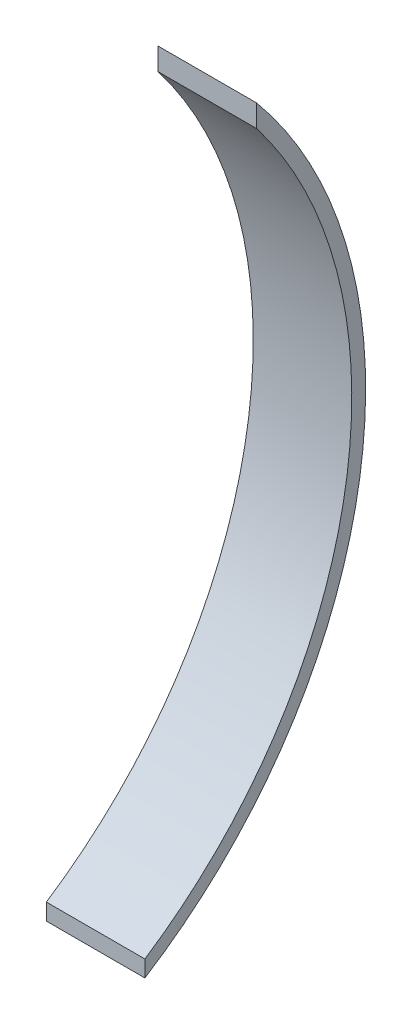
ISO-10303-21;
HEADER;
FILE_DESCRIPTION(('STEP AP214'),'2;1');
FILE_NAME('part.step','',(''),(''),'','','');
FILE_SCHEMA(('AUTOMOTIVE_DESIGN { 1 0 10303 214 1 1 1 1 }'));
ENDSEC;
DATA;
#1=APPLICATION_CONTEXT('core data for automotive mechanical design processes');
#2=APPLICATION_PROTOCOL_DEFINITION('international standard','automotive_design',2000,#1);
#3=PRODUCT_CONTEXT('',#1,'mechanical');
#4=PRODUCT('Part','Part','',(#3));
#5=PRODUCT_RELATED_PRODUCT_CATEGORY('part','',(#4));
#6=PRODUCT_DEFINITION_FORMATION('','',#4);
#7=PRODUCT_DEFINITION_CONTEXT('part definition',#1,'design');
#8=PRODUCT_DEFINITION('design','',#6,#7);
#9=PRODUCT_DEFINITION_SHAPE('','',#8);
#10=(LENGTH_UNIT() NAMED_UNIT(*) SI_UNIT(.MILLI.,.METRE.));
#11=(NAMED_UNIT(*) PLANE_ANGLE_UNIT() SI_UNIT($,.RADIAN.));
#12=(NAMED_UNIT(*) SI_UNIT($,.STERADIAN.) SOLID_ANGLE_UNIT());
#13=UNCERTAINTY_MEASURE_WITH_UNIT(LENGTH_MEASURE(1.E-05),#10,'distance_accuracy_value','');
#14=(GEOMETRIC_REPRESENTATION_CONTEXT(3) GLOBAL_UNCERTAINTY_ASSIGNED_CONTEXT((#13)) GLOBAL_UNIT_ASSIGNED_CONTEXT((#10,
#11,#12)) REPRESENTATION_CONTEXT('',''));
#15=CARTESIAN_POINT('',(0.,0.,0.));
#16=DIRECTION('',(0.,0.,1.));
#17=DIRECTION('',(1.,0.,0.));
#18=AXIS2_PLACEMENT_3D('',#15,#16,#17);
#19=CARTESIAN_POINT('',(30.,-30.789886547677,76.726917698007));
#20=DIRECTION('',(-1.,0.,0.));
#21=DIRECTION('',(0.,0.,1.));
#22=AXIS2_PLACEMENT_3D('',#19,#20,#21);
#23=CYLINDRICAL_SURFACE('',#22,139.726917698007);
#24=CARTESIAN_POINT('',(0.,-30.789886547677,76.726917698007));
#25=DIRECTION('',(-1.,0.,0.));
#26=DIRECTION('',(0.,0.,1.));
#27=AXIS2_PLACEMENT_3D('',#24,#25,#26);
#28=CIRCLE('',#27,139.726917698007);
#29=CARTESIAN_POINT('',(0.,54.4342956219654,-34.));
#30=VERTEX_POINT('',#29);
#31=CARTESIAN_POINT('',(0.,-147.565704378035,0.));
#32=VERTEX_POINT('',#31);
#33=EDGE_CURVE('E117',#30,#32,#28,.T.);
#34=ORIENTED_EDGE('',*,*,#33,.T.);
#35=DIRECTION('',(-1.,0.,0.));
#36=VECTOR('',#35,1.);
#37=CARTESIAN_POINT('',(30.,-147.565704378035,0.));
#38=LINE('',#37,#36);
#39=CARTESIAN_POINT('',(30.,-147.565704378035,0.));
#40=VERTEX_POINT('',#39);
#41=EDGE_CURVE('E13',#40,#32,#38,.T.);
#42=ORIENTED_EDGE('',*,*,#41,.F.);
#43=CARTESIAN_POINT('',(30.,-30.789886547677,76.726917698007));
#44=DIRECTION('',(-1.,0.,0.));
#45=DIRECTION('',(0.,0.,1.));
#46=AXIS2_PLACEMENT_3D('',#43,#44,#45);
#47=CIRCLE('',#46,139.726917698007);
#48=CARTESIAN_POINT('',(30.,54.4342956219654,-34.));
#49=VERTEX_POINT('',#48);
#50=EDGE_CURVE('E101',#49,#40,#47,.T.);
#51=ORIENTED_EDGE('',*,*,#50,.F.);
#52=DIRECTION('',(-1.,0.,0.));
#53=VECTOR('',#52,1.);
#54=CARTESIAN_POINT('',(30.,54.4342956219654,-34.));
#55=LINE('',#54,#53);
#56=EDGE_CURVE('E113',#49,#30,#55,.T.);
#57=ORIENTED_EDGE('',*,*,#56,.T.);
#58=EDGE_LOOP('',(#34,#42,#51,#57));
#59=FACE_BOUND('',#58,.T.);
#60=ADVANCED_FACE('F49',(#59),#23,.F.);
#61=CARTESIAN_POINT('',(30.,-147.565704378035,0.));
#62=DIRECTION('',(0.,0.,-1.));
#63=DIRECTION('',(0.,1.,0.));
#64=AXIS2_PLACEMENT_3D('',#61,#62,#63);
#65=PLANE('',#64);
#66=DIRECTION('',(0.,-1.,0.));
#67=VECTOR('',#66,1.);
#68=CARTESIAN_POINT('',(0.,-147.565704378035,0.));
#69=LINE('',#68,#67);
#70=CARTESIAN_POINT('',(0.,-152.588372424716,0.));
#71=VERTEX_POINT('',#70);
#72=EDGE_CURVE('E106',#32,#71,#69,.T.);
#73=ORIENTED_EDGE('',*,*,#72,.T.);
#74=DIRECTION('',(-1.,0.,0.));
#75=VECTOR('',#74,1.);
#76=CARTESIAN_POINT('',(30.,-152.588372424716,0.));
#77=LINE('',#76,#75);
#78=CARTESIAN_POINT('',(30.,-152.588372424716,0.));
#79=VERTEX_POINT('',#78);
#80=EDGE_CURVE('E58',#79,#71,#77,.T.);
#81=ORIENTED_EDGE('',*,*,#80,.F.);
#82=DIRECTION('',(0.,-1.,0.));
#83=VECTOR('',#82,1.);
#84=CARTESIAN_POINT('',(30.,-147.565704378035,0.));
#85=LINE('',#84,#83);
#86=EDGE_CURVE('E96',#40,#79,#85,.T.);
#87=ORIENTED_EDGE('',*,*,#86,.F.);
#88=ORIENTED_EDGE('',*,*,#41,.T.);
#89=EDGE_LOOP('',(#73,#81,#87,#88));
#90=FACE_BOUND('',#89,.T.);
#91=ADVANCED_FACE('F105',(#90),#65,.F.);
#92=CARTESIAN_POINT('',(30.,-30.789886547677,76.726917698007));
#93=DIRECTION('',(-1.,0.,0.));
#94=DIRECTION('',(0.,0.,1.));
#95=AXIS2_PLACEMENT_3D('',#92,#93,#94);
#96=CYLINDRICAL_SURFACE('',#95,143.951002293753);
#97=CARTESIAN_POINT('',(0.,-30.789886547677,76.726917698007));
#98=DIRECTION('',(1.,0.,0.));
#99=DIRECTION('',(0.,0.,1.));
#100=AXIS2_PLACEMENT_3D('',#97,#98,#99);
#101=CIRCLE('',#100,143.951002293753);
#102=CARTESIAN_POINT('',(0.,61.196203479429,-34.));
#103=VERTEX_POINT('',#102);
#104=EDGE_CURVE('E83',#71,#103,#101,.T.);
#105=ORIENTED_EDGE('',*,*,#104,.T.);
#106=DIRECTION('',(-1.,0.,0.));
#107=VECTOR('',#106,1.);
#108=CARTESIAN_POINT('',(30.,61.196203479429,-34.));
#109=LINE('',#108,#107);
#110=CARTESIAN_POINT('',(30.,61.196203479429,-34.));
#111=VERTEX_POINT('',#110);
#112=EDGE_CURVE('E108',#111,#103,#109,.T.);
#113=ORIENTED_EDGE('',*,*,#112,.F.);
#114=CARTESIAN_POINT('',(30.,-30.789886547677,76.726917698007));
#115=DIRECTION('',(1.,0.,0.));
#116=DIRECTION('',(0.,0.,1.));
#117=AXIS2_PLACEMENT_3D('',#114,#115,#116);
#118=CIRCLE('',#117,143.951002293753);
#119=EDGE_CURVE('E99',#79,#111,#118,.T.);
#120=ORIENTED_EDGE('',*,*,#119,.F.);
#121=ORIENTED_EDGE('',*,*,#80,.T.);
#122=EDGE_LOOP('',(#105,#113,#120,#121));
#123=FACE_BOUND('',#122,.T.);
#124=ADVANCED_FACE('F109',(#123),#96,.T.);
#125=CARTESIAN_POINT('',(30.,61.196203479429,-34.));
#126=DIRECTION('',(0.,0.,-1.));
#127=DIRECTION('',(-1.,0.,0.));
#128=AXIS2_PLACEMENT_3D('',#125,#126,#127);
#129=PLANE('',#128);
#130=DIRECTION('',(0.,-1.,0.));
#131=VECTOR('',#130,1.);
#132=CARTESIAN_POINT('',(0.,61.196203479429,-34.));
#133=LINE('',#132,#131);
#134=EDGE_CURVE('E89',#103,#30,#133,.T.);
#135=ORIENTED_EDGE('',*,*,#134,.T.);
#136=ORIENTED_EDGE('',*,*,#56,.F.);
#137=DIRECTION('',(0.,-1.,0.));
#138=VECTOR('',#137,1.);
#139=CARTESIAN_POINT('',(30.,61.196203479429,-34.));
#140=LINE('',#139,#138);
#141=EDGE_CURVE('E66',#111,#49,#140,.T.);
#142=ORIENTED_EDGE('',*,*,#141,.F.);
#143=ORIENTED_EDGE('',*,*,#112,.T.);
#144=EDGE_LOOP('',(#135,#136,#142,#143));
#145=FACE_BOUND('',#144,.T.);
#146=ADVANCED_FACE('F130',(#145),#129,.F.);
#147=CARTESIAN_POINT('',(30.,-30.789886547677,76.726917698007));
#148=DIRECTION('',(-1.,0.,0.));
#149=DIRECTION('',(0.,0.,1.));
#150=AXIS2_PLACEMENT_3D('',#147,#148,#149);
#151=PLANE('',#150);
#152=ORIENTED_EDGE('',*,*,#50,.T.);
#153=ORIENTED_EDGE('',*,*,#86,.T.);
#154=ORIENTED_EDGE('',*,*,#119,.T.);
#155=ORIENTED_EDGE('',*,*,#141,.T.);
#156=EDGE_LOOP('',(#152,#153,#154,#155));
#157=FACE_BOUND('',#156,.T.);
#158=ADVANCED_FACE('F97',(#157),#151,.F.);
#159=CARTESIAN_POINT('',(0.,-30.789886547677,76.726917698007));
#160=DIRECTION('',(-1.,0.,0.));
#161=DIRECTION('',(0.,0.,1.));
#162=AXIS2_PLACEMENT_3D('',#159,#160,#161);
#163=PLANE('',#162);
#164=ORIENTED_EDGE('',*,*,#33,.F.);
#165=ORIENTED_EDGE('',*,*,#134,.F.);
#166=ORIENTED_EDGE('',*,*,#104,.F.);
#167=ORIENTED_EDGE('',*,*,#72,.F.);
#168=EDGE_LOOP('',(#164,#165,#166,#167));
#169=FACE_BOUND('',#168,.T.);
#170=ADVANCED_FACE('F133',(#169),#163,.T.);
#171=CLOSED_SHELL('',(#60,#91,#124,#146,#158,#170));
#172=MANIFOLD_SOLID_BREP('B2',#171);
#173=ADVANCED_BREP_SHAPE_REPRESENTATION('',(#18,#172),#14);
#174=SHAPE_DEFINITION_REPRESENTATION(#9,#173);
ENDSEC;
END-ISO-10303-21;
